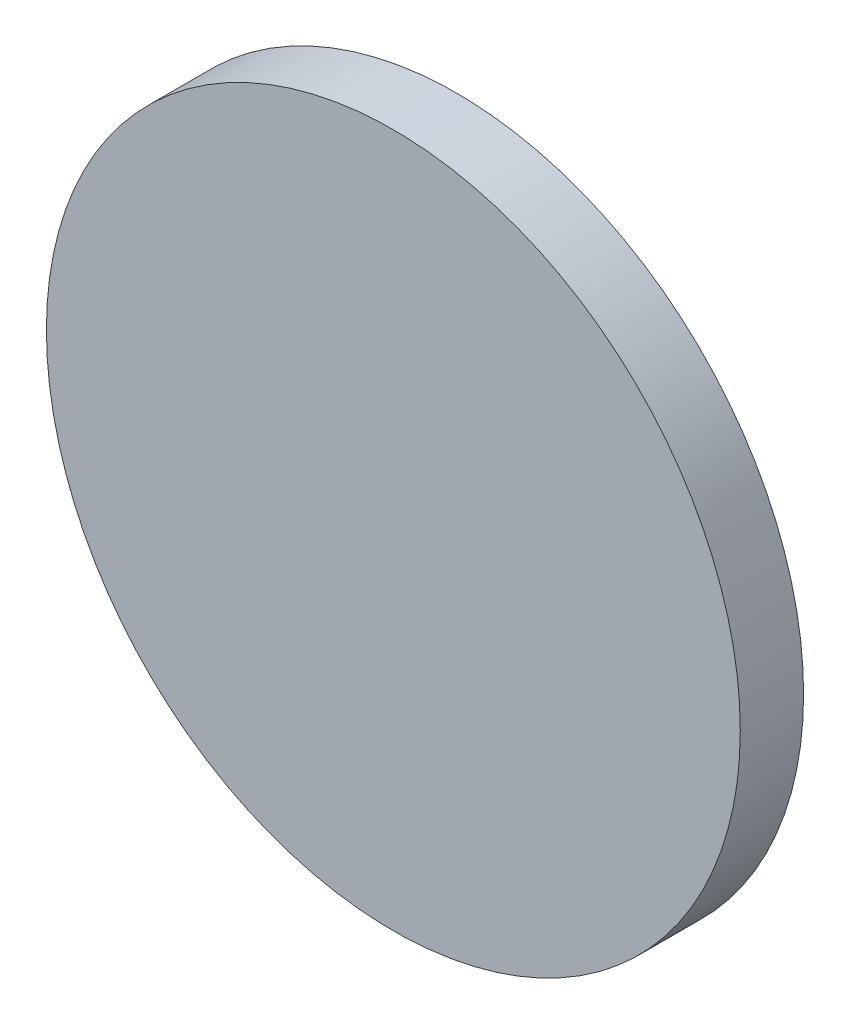
ISO-10303-21;
HEADER;
FILE_DESCRIPTION(('STEP AP214'),'2;1');
FILE_NAME('part.step','',(''),(''),'','','');
FILE_SCHEMA(('AUTOMOTIVE_DESIGN { 1 0 10303 214 1 1 1 1 }'));
ENDSEC;
DATA;
#1=APPLICATION_CONTEXT('core data for automotive mechanical design processes');
#2=APPLICATION_PROTOCOL_DEFINITION('international standard','automotive_design',2000,#1);
#3=PRODUCT_CONTEXT('',#1,'mechanical');
#4=PRODUCT('Part','Part','',(#3));
#5=PRODUCT_RELATED_PRODUCT_CATEGORY('part','',(#4));
#6=PRODUCT_DEFINITION_FORMATION('','',#4);
#7=PRODUCT_DEFINITION_CONTEXT('part definition',#1,'design');
#8=PRODUCT_DEFINITION('design','',#6,#7);
#9=PRODUCT_DEFINITION_SHAPE('','',#8);
#10=(LENGTH_UNIT() NAMED_UNIT(*) SI_UNIT(.MILLI.,.METRE.));
#11=(NAMED_UNIT(*) PLANE_ANGLE_UNIT() SI_UNIT($,.RADIAN.));
#12=(NAMED_UNIT(*) SI_UNIT($,.STERADIAN.) SOLID_ANGLE_UNIT());
#13=UNCERTAINTY_MEASURE_WITH_UNIT(LENGTH_MEASURE(1.E-05),#10,'distance_accuracy_value','');
#14=(GEOMETRIC_REPRESENTATION_CONTEXT(3) GLOBAL_UNCERTAINTY_ASSIGNED_CONTEXT((#13)) GLOBAL_UNIT_ASSIGNED_CONTEXT((#10,
#11,#12)) REPRESENTATION_CONTEXT('',''));
#15=CARTESIAN_POINT('',(0.,0.,0.));
#16=DIRECTION('',(0.,0.,1.));
#17=DIRECTION('',(1.,0.,0.));
#18=AXIS2_PLACEMENT_3D('',#15,#16,#17);
#19=CARTESIAN_POINT('',(0.,0.,10.));
#20=DIRECTION('',(0.,0.,-1.));
#21=DIRECTION('',(-1.,0.,0.));
#22=AXIS2_PLACEMENT_3D('',#19,#20,#21);
#23=CYLINDRICAL_SURFACE('',#22,54.8);
#24=CARTESIAN_POINT('',(0.,0.,10.));
#25=DIRECTION('',(0.,0.,-1.));
#26=DIRECTION('',(1.,0.,0.));
#27=AXIS2_PLACEMENT_3D('',#24,#25,#26);
#28=CIRCLE('',#27,54.8);
#29=CARTESIAN_POINT('',(54.8,0.,10.));
#30=VERTEX_POINT('',#29);
#31=EDGE_CURVE('E10',#30,#30,#28,.T.);
#32=ORIENTED_EDGE('',*,*,#31,.T.);
#33=EDGE_LOOP('',(#32));
#34=FACE_BOUND('',#33,.T.);
#35=CARTESIAN_POINT('',(0.,0.,0.));
#36=DIRECTION('',(0.,0.,-1.));
#37=DIRECTION('',(1.,0.,0.));
#38=AXIS2_PLACEMENT_3D('',#35,#36,#37);
#39=CIRCLE('',#38,54.8);
#40=CARTESIAN_POINT('',(54.8,0.,0.));
#41=VERTEX_POINT('',#40);
#42=EDGE_CURVE('E18',#41,#41,#39,.T.);
#43=ORIENTED_EDGE('',*,*,#42,.F.);
#44=EDGE_LOOP('',(#43));
#45=FACE_BOUND('',#44,.T.);
#46=ADVANCED_FACE('F15',(#34,#45),#23,.T.);
#47=CARTESIAN_POINT('',(0.,0.,10.));
#48=DIRECTION('',(0.,0.,-1.));
#49=DIRECTION('',(-1.,0.,0.));
#50=AXIS2_PLACEMENT_3D('',#47,#48,#49);
#51=PLANE('',#50);
#52=ORIENTED_EDGE('',*,*,#31,.F.);
#53=EDGE_LOOP('',(#52));
#54=FACE_BOUND('',#53,.T.);
#55=ADVANCED_FACE('F33',(#54),#51,.F.);
#56=CARTESIAN_POINT('',(0.,0.,0.));
#57=DIRECTION('',(0.,0.,-1.));
#58=DIRECTION('',(-1.,0.,0.));
#59=AXIS2_PLACEMENT_3D('',#56,#57,#58);
#60=PLANE('',#59);
#61=ORIENTED_EDGE('',*,*,#42,.T.);
#62=EDGE_LOOP('',(#61));
#63=FACE_BOUND('',#62,.T.);
#64=ADVANCED_FACE('F30',(#63),#60,.T.);
#65=CLOSED_SHELL('',(#46,#55,#64));
#66=MANIFOLD_SOLID_BREP('B1',#65);
#67=ADVANCED_BREP_SHAPE_REPRESENTATION('',(#18,#66),#14);
#68=SHAPE_DEFINITION_REPRESENTATION(#9,#67);
ENDSEC;
END-ISO-10303-21;
